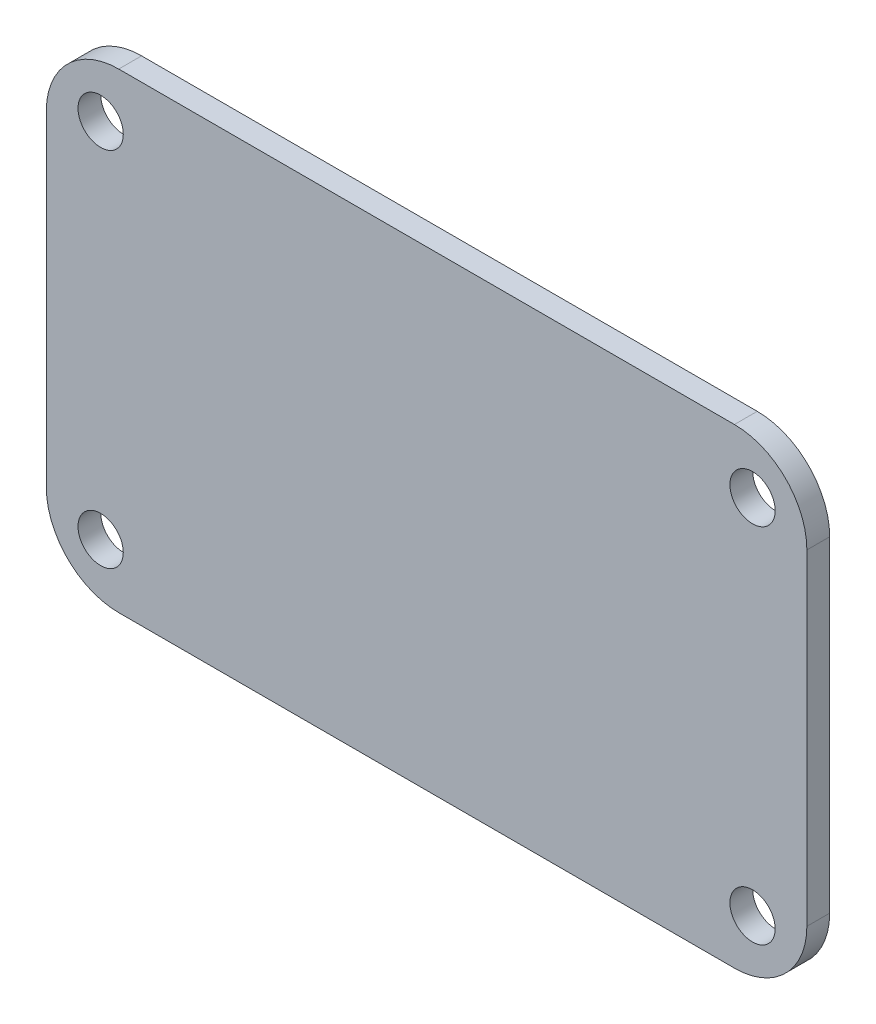
ISO-10303-21;
HEADER;
FILE_DESCRIPTION(('STEP AP214'),'2;1');
FILE_NAME('part.step','',(''),(''),'','','');
FILE_SCHEMA(('AUTOMOTIVE_DESIGN { 1 0 10303 214 1 1 1 1 }'));
ENDSEC;
DATA;
#1=APPLICATION_CONTEXT('core data for automotive mechanical design processes');
#2=APPLICATION_PROTOCOL_DEFINITION('international standard','automotive_design',2000,#1);
#3=PRODUCT_CONTEXT('',#1,'mechanical');
#4=PRODUCT('Part','Part','',(#3));
#5=PRODUCT_RELATED_PRODUCT_CATEGORY('part','',(#4));
#6=PRODUCT_DEFINITION_FORMATION('','',#4);
#7=PRODUCT_DEFINITION_CONTEXT('part definition',#1,'design');
#8=PRODUCT_DEFINITION('design','',#6,#7);
#9=PRODUCT_DEFINITION_SHAPE('','',#8);
#10=(LENGTH_UNIT() NAMED_UNIT(*) SI_UNIT(.MILLI.,.METRE.));
#11=(NAMED_UNIT(*) PLANE_ANGLE_UNIT() SI_UNIT($,.RADIAN.));
#12=(NAMED_UNIT(*) SI_UNIT($,.STERADIAN.) SOLID_ANGLE_UNIT());
#13=UNCERTAINTY_MEASURE_WITH_UNIT(LENGTH_MEASURE(1.E-05),#10,'distance_accuracy_value','');
#14=(GEOMETRIC_REPRESENTATION_CONTEXT(3) GLOBAL_UNCERTAINTY_ASSIGNED_CONTEXT((#13)) GLOBAL_UNIT_ASSIGNED_CONTEXT((#10,
#11,#12)) REPRESENTATION_CONTEXT('',''));
#15=CARTESIAN_POINT('',(0.,0.,0.));
#16=DIRECTION('',(0.,0.,1.));
#17=DIRECTION('',(1.,0.,0.));
#18=AXIS2_PLACEMENT_3D('',#15,#16,#17);
#19=CARTESIAN_POINT('',(-21.59,-11.43,-1.6002));
#20=DIRECTION('',(0.,0.,1.));
#21=DIRECTION('',(1.,0.,0.));
#22=AXIS2_PLACEMENT_3D('',#19,#20,#21);
#23=CYLINDRICAL_SURFACE('',#22,5.08);
#24=CARTESIAN_POINT('',(-21.59,-11.43,0.));
#25=DIRECTION('',(0.,0.,1.));
#26=DIRECTION('',(1.,0.,0.));
#27=AXIS2_PLACEMENT_3D('',#24,#25,#26);
#28=CIRCLE('',#27,5.08);
#29=CARTESIAN_POINT('',(-26.67,-11.43,0.));
#30=VERTEX_POINT('',#29);
#31=CARTESIAN_POINT('',(-21.59,-16.51,0.));
#32=VERTEX_POINT('',#31);
#33=EDGE_CURVE('E130',#30,#32,#28,.T.);
#34=ORIENTED_EDGE('',*,*,#33,.F.);
#35=DIRECTION('',(0.,0.,1.));
#36=VECTOR('',#35,1.);
#37=CARTESIAN_POINT('',(-26.67,-11.43,-1.6002));
#38=LINE('',#37,#36);
#39=CARTESIAN_POINT('',(-26.67,-11.43,-1.6002));
#40=VERTEX_POINT('',#39);
#41=EDGE_CURVE('E11',#40,#30,#38,.T.);
#42=ORIENTED_EDGE('',*,*,#41,.F.);
#43=CARTESIAN_POINT('',(-21.59,-11.43,-1.6002));
#44=DIRECTION('',(0.,0.,1.));
#45=DIRECTION('',(1.,0.,0.));
#46=AXIS2_PLACEMENT_3D('',#43,#44,#45);
#47=CIRCLE('',#46,5.08);
#48=CARTESIAN_POINT('',(-21.59,-16.51,-1.6002));
#49=VERTEX_POINT('',#48);
#50=EDGE_CURVE('E151',#40,#49,#47,.T.);
#51=ORIENTED_EDGE('',*,*,#50,.T.);
#52=DIRECTION('',(0.,0.,1.));
#53=VECTOR('',#52,1.);
#54=CARTESIAN_POINT('',(-21.59,-16.51,-1.6002));
#55=LINE('',#54,#53);
#56=EDGE_CURVE('E36',#49,#32,#55,.T.);
#57=ORIENTED_EDGE('',*,*,#56,.T.);
#58=EDGE_LOOP('',(#34,#42,#51,#57));
#59=FACE_BOUND('',#58,.T.);
#60=ADVANCED_FACE('F33',(#59),#23,.T.);
#61=CARTESIAN_POINT('',(-26.67,11.43,-1.6002));
#62=DIRECTION('',(-1.,0.,0.));
#63=DIRECTION('',(0.,-1.,0.));
#64=AXIS2_PLACEMENT_3D('',#61,#62,#63);
#65=PLANE('',#64);
#66=DIRECTION('',(0.,-1.,0.));
#67=VECTOR('',#66,1.);
#68=CARTESIAN_POINT('',(-26.67,11.43,0.));
#69=LINE('',#68,#67);
#70=CARTESIAN_POINT('',(-26.67,11.43,0.));
#71=VERTEX_POINT('',#70);
#72=EDGE_CURVE('E149',#71,#30,#69,.T.);
#73=ORIENTED_EDGE('',*,*,#72,.F.);
#74=DIRECTION('',(0.,0.,1.));
#75=VECTOR('',#74,1.);
#76=CARTESIAN_POINT('',(-26.67,11.43,-1.6002));
#77=LINE('',#76,#75);
#78=CARTESIAN_POINT('',(-26.67,11.43,-1.6002));
#79=VERTEX_POINT('',#78);
#80=EDGE_CURVE('E42',#79,#71,#77,.T.);
#81=ORIENTED_EDGE('',*,*,#80,.F.);
#82=DIRECTION('',(0.,-1.,0.));
#83=VECTOR('',#82,1.);
#84=CARTESIAN_POINT('',(-26.67,11.43,-1.6002));
#85=LINE('',#84,#83);
#86=EDGE_CURVE('E120',#79,#40,#85,.T.);
#87=ORIENTED_EDGE('',*,*,#86,.T.);
#88=ORIENTED_EDGE('',*,*,#41,.T.);
#89=EDGE_LOOP('',(#73,#81,#87,#88));
#90=FACE_BOUND('',#89,.T.);
#91=ADVANCED_FACE('F163',(#90),#65,.T.);
#92=CARTESIAN_POINT('',(-21.59,11.43,-1.6002));
#93=DIRECTION('',(0.,0.,1.));
#94=DIRECTION('',(1.,0.,0.));
#95=AXIS2_PLACEMENT_3D('',#92,#93,#94);
#96=CYLINDRICAL_SURFACE('',#95,5.08);
#97=CARTESIAN_POINT('',(-21.59,11.43,0.));
#98=DIRECTION('',(0.,0.,1.));
#99=DIRECTION('',(1.,0.,0.));
#100=AXIS2_PLACEMENT_3D('',#97,#98,#99);
#101=CIRCLE('',#100,5.08);
#102=CARTESIAN_POINT('',(-21.59,16.51,0.));
#103=VERTEX_POINT('',#102);
#104=EDGE_CURVE('E107',#103,#71,#101,.T.);
#105=ORIENTED_EDGE('',*,*,#104,.F.);
#106=DIRECTION('',(0.,0.,1.));
#107=VECTOR('',#106,1.);
#108=CARTESIAN_POINT('',(-21.59,16.51,-1.6002));
#109=LINE('',#108,#107);
#110=CARTESIAN_POINT('',(-21.59,16.51,-1.6002));
#111=VERTEX_POINT('',#110);
#112=EDGE_CURVE('E102',#111,#103,#109,.T.);
#113=ORIENTED_EDGE('',*,*,#112,.F.);
#114=CARTESIAN_POINT('',(-21.59,11.43,-1.6002));
#115=DIRECTION('',(0.,0.,1.));
#116=DIRECTION('',(1.,0.,0.));
#117=AXIS2_PLACEMENT_3D('',#114,#115,#116);
#118=CIRCLE('',#117,5.08);
#119=EDGE_CURVE('E105',#111,#79,#118,.T.);
#120=ORIENTED_EDGE('',*,*,#119,.T.);
#121=ORIENTED_EDGE('',*,*,#80,.T.);
#122=EDGE_LOOP('',(#105,#113,#120,#121));
#123=FACE_BOUND('',#122,.T.);
#124=ADVANCED_FACE('F104',(#123),#96,.T.);
#125=CARTESIAN_POINT('',(-21.59,16.51,-1.6002));
#126=DIRECTION('',(0.,1.,0.));
#127=DIRECTION('',(0.,0.,1.));
#128=AXIS2_PLACEMENT_3D('',#125,#126,#127);
#129=PLANE('',#128);
#130=DIRECTION('',(-1.,0.,0.));
#131=VECTOR('',#130,1.);
#132=CARTESIAN_POINT('',(-21.59,16.51,0.));
#133=LINE('',#132,#131);
#134=CARTESIAN_POINT('',(21.59,16.51,0.));
#135=VERTEX_POINT('',#134);
#136=EDGE_CURVE('E146',#135,#103,#133,.T.);
#137=ORIENTED_EDGE('',*,*,#136,.F.);
#138=DIRECTION('',(0.,0.,1.));
#139=VECTOR('',#138,1.);
#140=CARTESIAN_POINT('',(21.59,16.51,-1.6002));
#141=LINE('',#140,#139);
#142=CARTESIAN_POINT('',(21.59,16.51,-1.6002));
#143=VERTEX_POINT('',#142);
#144=EDGE_CURVE('E112',#143,#135,#141,.T.);
#145=ORIENTED_EDGE('',*,*,#144,.F.);
#146=DIRECTION('',(-1.,0.,0.));
#147=VECTOR('',#146,1.);
#148=CARTESIAN_POINT('',(-21.59,16.51,-1.6002));
#149=LINE('',#148,#147);
#150=EDGE_CURVE('E118',#143,#111,#149,.T.);
#151=ORIENTED_EDGE('',*,*,#150,.T.);
#152=ORIENTED_EDGE('',*,*,#112,.T.);
#153=EDGE_LOOP('',(#137,#145,#151,#152));
#154=FACE_BOUND('',#153,.T.);
#155=ADVANCED_FACE('F122',(#154),#129,.T.);
#156=CARTESIAN_POINT('',(21.59,11.43,-1.6002));
#157=DIRECTION('',(0.,0.,1.));
#158=DIRECTION('',(1.,0.,0.));
#159=AXIS2_PLACEMENT_3D('',#156,#157,#158);
#160=CYLINDRICAL_SURFACE('',#159,5.08);
#161=CARTESIAN_POINT('',(21.59,11.43,0.));
#162=DIRECTION('',(0.,0.,1.));
#163=DIRECTION('',(-1.,0.,0.));
#164=AXIS2_PLACEMENT_3D('',#161,#162,#163);
#165=CIRCLE('',#164,5.08);
#166=CARTESIAN_POINT('',(26.67,11.43,0.));
#167=VERTEX_POINT('',#166);
#168=EDGE_CURVE('E143',#167,#135,#165,.T.);
#169=ORIENTED_EDGE('',*,*,#168,.F.);
#170=DIRECTION('',(0.,0.,1.));
#171=VECTOR('',#170,1.);
#172=CARTESIAN_POINT('',(26.67,11.43,-1.6002));
#173=LINE('',#172,#171);
#174=CARTESIAN_POINT('',(26.67,11.43,-1.6002));
#175=VERTEX_POINT('',#174);
#176=EDGE_CURVE('E155',#175,#167,#173,.T.);
#177=ORIENTED_EDGE('',*,*,#176,.F.);
#178=CARTESIAN_POINT('',(21.59,11.43,-1.6002));
#179=DIRECTION('',(0.,0.,1.));
#180=DIRECTION('',(-1.,0.,0.));
#181=AXIS2_PLACEMENT_3D('',#178,#179,#180);
#182=CIRCLE('',#181,5.08);
#183=EDGE_CURVE('E123',#175,#143,#182,.T.);
#184=ORIENTED_EDGE('',*,*,#183,.T.);
#185=ORIENTED_EDGE('',*,*,#144,.T.);
#186=EDGE_LOOP('',(#169,#177,#184,#185));
#187=FACE_BOUND('',#186,.T.);
#188=ADVANCED_FACE('F176',(#187),#160,.T.);
#189=CARTESIAN_POINT('',(26.67,11.43,-1.6002));
#190=DIRECTION('',(1.,0.,0.));
#191=DIRECTION('',(0.,1.,0.));
#192=AXIS2_PLACEMENT_3D('',#189,#190,#191);
#193=PLANE('',#192);
#194=DIRECTION('',(0.,1.,0.));
#195=VECTOR('',#194,1.);
#196=CARTESIAN_POINT('',(26.67,11.43,0.));
#197=LINE('',#196,#195);
#198=CARTESIAN_POINT('',(26.67,-11.43,0.));
#199=VERTEX_POINT('',#198);
#200=EDGE_CURVE('E140',#199,#167,#197,.T.);
#201=ORIENTED_EDGE('',*,*,#200,.F.);
#202=DIRECTION('',(0.,0.,1.));
#203=VECTOR('',#202,1.);
#204=CARTESIAN_POINT('',(26.67,-11.43,-1.6002));
#205=LINE('',#204,#203);
#206=CARTESIAN_POINT('',(26.67,-11.43,-1.6002));
#207=VERTEX_POINT('',#206);
#208=EDGE_CURVE('E157',#207,#199,#205,.T.);
#209=ORIENTED_EDGE('',*,*,#208,.F.);
#210=DIRECTION('',(0.,1.,0.));
#211=VECTOR('',#210,1.);
#212=CARTESIAN_POINT('',(26.67,11.43,-1.6002));
#213=LINE('',#212,#211);
#214=EDGE_CURVE('E125',#207,#175,#213,.T.);
#215=ORIENTED_EDGE('',*,*,#214,.T.);
#216=ORIENTED_EDGE('',*,*,#176,.T.);
#217=EDGE_LOOP('',(#201,#209,#215,#216));
#218=FACE_BOUND('',#217,.T.);
#219=ADVANCED_FACE('F179',(#218),#193,.T.);
#220=CARTESIAN_POINT('',(21.59,-11.43,-1.6002));
#221=DIRECTION('',(0.,0.,1.));
#222=DIRECTION('',(1.,0.,0.));
#223=AXIS2_PLACEMENT_3D('',#220,#221,#222);
#224=CYLINDRICAL_SURFACE('',#223,5.08);
#225=CARTESIAN_POINT('',(21.59,-11.43,0.));
#226=DIRECTION('',(0.,0.,1.));
#227=DIRECTION('',(1.,0.,0.));
#228=AXIS2_PLACEMENT_3D('',#225,#226,#227);
#229=CIRCLE('',#228,5.08);
#230=CARTESIAN_POINT('',(21.59,-16.51,0.));
#231=VERTEX_POINT('',#230);
#232=EDGE_CURVE('E137',#231,#199,#229,.T.);
#233=ORIENTED_EDGE('',*,*,#232,.F.);
#234=DIRECTION('',(0.,0.,1.));
#235=VECTOR('',#234,1.);
#236=CARTESIAN_POINT('',(21.59,-16.51,-1.6002));
#237=LINE('',#236,#235);
#238=CARTESIAN_POINT('',(21.59,-16.51,-1.6002));
#239=VERTEX_POINT('',#238);
#240=EDGE_CURVE('E158',#239,#231,#237,.T.);
#241=ORIENTED_EDGE('',*,*,#240,.F.);
#242=CARTESIAN_POINT('',(21.59,-11.43,-1.6002));
#243=DIRECTION('',(0.,0.,1.));
#244=DIRECTION('',(1.,0.,0.));
#245=AXIS2_PLACEMENT_3D('',#242,#243,#244);
#246=CIRCLE('',#245,5.08);
#247=EDGE_CURVE('E245',#239,#207,#246,.T.);
#248=ORIENTED_EDGE('',*,*,#247,.T.);
#249=ORIENTED_EDGE('',*,*,#208,.T.);
#250=EDGE_LOOP('',(#233,#241,#248,#249));
#251=FACE_BOUND('',#250,.T.);
#252=ADVANCED_FACE('F183',(#251),#224,.T.);
#253=CARTESIAN_POINT('',(-21.59,-16.51,-1.6002));
#254=DIRECTION('',(0.,-1.,0.));
#255=DIRECTION('',(0.,0.,-1.));
#256=AXIS2_PLACEMENT_3D('',#253,#254,#255);
#257=PLANE('',#256);
#258=DIRECTION('',(1.,0.,0.));
#259=VECTOR('',#258,1.);
#260=CARTESIAN_POINT('',(-21.59,-16.51,0.));
#261=LINE('',#260,#259);
#262=EDGE_CURVE('E133',#32,#231,#261,.T.);
#263=ORIENTED_EDGE('',*,*,#262,.F.);
#264=ORIENTED_EDGE('',*,*,#56,.F.);
#265=DIRECTION('',(1.,0.,0.));
#266=VECTOR('',#265,1.);
#267=CARTESIAN_POINT('',(-21.59,-16.51,-1.6002));
#268=LINE('',#267,#266);
#269=EDGE_CURVE('E243',#49,#239,#268,.T.);
#270=ORIENTED_EDGE('',*,*,#269,.T.);
#271=ORIENTED_EDGE('',*,*,#240,.T.);
#272=EDGE_LOOP('',(#263,#264,#270,#271));
#273=FACE_BOUND('',#272,.T.);
#274=ADVANCED_FACE('F160',(#273),#257,.T.);
#275=CARTESIAN_POINT('',(-21.59,-11.43,-1.6002));
#276=DIRECTION('',(0.,0.,1.));
#277=DIRECTION('',(1.,0.,0.));
#278=AXIS2_PLACEMENT_3D('',#275,#276,#277);
#279=PLANE('',#278);
#280=CARTESIAN_POINT('',(22.86,-12.7,-1.6002));
#281=DIRECTION('',(0.,0.,1.));
#282=DIRECTION('',(1.,0.,0.));
#283=AXIS2_PLACEMENT_3D('',#280,#281,#282);
#284=CIRCLE('',#283,1.5875);
#285=CARTESIAN_POINT('',(24.4475,-12.7,-1.6002));
#286=VERTEX_POINT('',#285);
#287=EDGE_CURVE('E221',#286,#286,#284,.T.);
#288=ORIENTED_EDGE('',*,*,#287,.T.);
#289=EDGE_LOOP('',(#288));
#290=FACE_BOUND('',#289,.T.);
#291=CARTESIAN_POINT('',(22.86,12.7,-1.6002));
#292=DIRECTION('',(0.,0.,1.));
#293=DIRECTION('',(1.,0.,0.));
#294=AXIS2_PLACEMENT_3D('',#291,#292,#293);
#295=CIRCLE('',#294,1.5875);
#296=CARTESIAN_POINT('',(24.4475,12.7,-1.6002));
#297=VERTEX_POINT('',#296);
#298=EDGE_CURVE('E225',#297,#297,#295,.T.);
#299=ORIENTED_EDGE('',*,*,#298,.T.);
#300=EDGE_LOOP('',(#299));
#301=FACE_BOUND('',#300,.T.);
#302=CARTESIAN_POINT('',(-22.86,-12.7,-1.6002));
#303=DIRECTION('',(0.,0.,1.));
#304=DIRECTION('',(1.,0.,0.));
#305=AXIS2_PLACEMENT_3D('',#302,#303,#304);
#306=CIRCLE('',#305,1.5875);
#307=CARTESIAN_POINT('',(-21.2725,-12.7,-1.6002));
#308=VERTEX_POINT('',#307);
#309=EDGE_CURVE('E234',#308,#308,#306,.T.);
#310=ORIENTED_EDGE('',*,*,#309,.T.);
#311=EDGE_LOOP('',(#310));
#312=FACE_BOUND('',#311,.T.);
#313=CARTESIAN_POINT('',(-22.86,12.7,-1.6002));
#314=DIRECTION('',(0.,0.,1.));
#315=DIRECTION('',(1.,0.,0.));
#316=AXIS2_PLACEMENT_3D('',#313,#314,#315);
#317=CIRCLE('',#316,1.5875);
#318=CARTESIAN_POINT('',(-21.2725,12.7,-1.6002));
#319=VERTEX_POINT('',#318);
#320=EDGE_CURVE('E134',#319,#319,#317,.T.);
#321=ORIENTED_EDGE('',*,*,#320,.T.);
#322=EDGE_LOOP('',(#321));
#323=FACE_BOUND('',#322,.T.);
#324=ORIENTED_EDGE('',*,*,#50,.F.);
#325=ORIENTED_EDGE('',*,*,#86,.F.);
#326=ORIENTED_EDGE('',*,*,#119,.F.);
#327=ORIENTED_EDGE('',*,*,#150,.F.);
#328=ORIENTED_EDGE('',*,*,#183,.F.);
#329=ORIENTED_EDGE('',*,*,#214,.F.);
#330=ORIENTED_EDGE('',*,*,#247,.F.);
#331=ORIENTED_EDGE('',*,*,#269,.F.);
#332=EDGE_LOOP('',(#324,#325,#326,#327,#328,#329,#330,#331));
#333=FACE_BOUND('',#332,.T.);
#334=ADVANCED_FACE('F116',(#290,#301,#312,#323,#333),#279,.F.);
#335=CARTESIAN_POINT('',(-21.59,-11.43,0.));
#336=DIRECTION('',(0.,0.,1.));
#337=DIRECTION('',(1.,0.,0.));
#338=AXIS2_PLACEMENT_3D('',#335,#336,#337);
#339=PLANE('',#338);
#340=CARTESIAN_POINT('',(22.86,-12.7,0.));
#341=DIRECTION('',(0.,0.,1.));
#342=DIRECTION('',(1.,0.,0.));
#343=AXIS2_PLACEMENT_3D('',#340,#341,#342);
#344=CIRCLE('',#343,1.5875);
#345=CARTESIAN_POINT('',(24.4475,-12.7,0.));
#346=VERTEX_POINT('',#345);
#347=EDGE_CURVE('E219',#346,#346,#344,.T.);
#348=ORIENTED_EDGE('',*,*,#347,.F.);
#349=EDGE_LOOP('',(#348));
#350=FACE_BOUND('',#349,.T.);
#351=CARTESIAN_POINT('',(22.86,12.7,0.));
#352=DIRECTION('',(0.,0.,1.));
#353=DIRECTION('',(1.,0.,0.));
#354=AXIS2_PLACEMENT_3D('',#351,#352,#353);
#355=CIRCLE('',#354,1.5875);
#356=CARTESIAN_POINT('',(24.4475,12.7,0.));
#357=VERTEX_POINT('',#356);
#358=EDGE_CURVE('E222',#357,#357,#355,.T.);
#359=ORIENTED_EDGE('',*,*,#358,.F.);
#360=EDGE_LOOP('',(#359));
#361=FACE_BOUND('',#360,.T.);
#362=CARTESIAN_POINT('',(-22.86,-12.7,0.));
#363=DIRECTION('',(0.,0.,1.));
#364=DIRECTION('',(1.,0.,0.));
#365=AXIS2_PLACEMENT_3D('',#362,#363,#364);
#366=CIRCLE('',#365,1.5875);
#367=CARTESIAN_POINT('',(-21.2725,-12.7,0.));
#368=VERTEX_POINT('',#367);
#369=EDGE_CURVE('E231',#368,#368,#366,.T.);
#370=ORIENTED_EDGE('',*,*,#369,.F.);
#371=EDGE_LOOP('',(#370));
#372=FACE_BOUND('',#371,.T.);
#373=CARTESIAN_POINT('',(-22.86,12.7,0.));
#374=DIRECTION('',(0.,0.,1.));
#375=DIRECTION('',(1.,0.,0.));
#376=AXIS2_PLACEMENT_3D('',#373,#374,#375);
#377=CIRCLE('',#376,1.5875);
#378=CARTESIAN_POINT('',(-21.2725,12.7,0.));
#379=VERTEX_POINT('',#378);
#380=EDGE_CURVE('E237',#379,#379,#377,.T.);
#381=ORIENTED_EDGE('',*,*,#380,.F.);
#382=EDGE_LOOP('',(#381));
#383=FACE_BOUND('',#382,.T.);
#384=ORIENTED_EDGE('',*,*,#33,.T.);
#385=ORIENTED_EDGE('',*,*,#262,.T.);
#386=ORIENTED_EDGE('',*,*,#232,.T.);
#387=ORIENTED_EDGE('',*,*,#200,.T.);
#388=ORIENTED_EDGE('',*,*,#168,.T.);
#389=ORIENTED_EDGE('',*,*,#136,.T.);
#390=ORIENTED_EDGE('',*,*,#104,.T.);
#391=ORIENTED_EDGE('',*,*,#72,.T.);
#392=EDGE_LOOP('',(#384,#385,#386,#387,#388,#389,#390,#391));
#393=FACE_BOUND('',#392,.T.);
#394=ADVANCED_FACE('F162',(#350,#361,#372,#383,#393),#339,.T.);
#395=CARTESIAN_POINT('',(-22.86,12.7,-11.7602));
#396=DIRECTION('',(0.,0.,1.));
#397=DIRECTION('',(1.,0.,0.));
#398=AXIS2_PLACEMENT_3D('',#395,#396,#397);
#399=CYLINDRICAL_SURFACE('',#398,1.5875);
#400=ORIENTED_EDGE('',*,*,#380,.T.);
#401=EDGE_LOOP('',(#400));
#402=FACE_BOUND('',#401,.T.);
#403=ORIENTED_EDGE('',*,*,#320,.F.);
#404=EDGE_LOOP('',(#403));
#405=FACE_BOUND('',#404,.T.);
#406=ADVANCED_FACE('F195',(#402,#405),#399,.F.);
#407=CARTESIAN_POINT('',(-22.86,-12.7,-11.7602));
#408=DIRECTION('',(0.,0.,1.));
#409=DIRECTION('',(1.,0.,0.));
#410=AXIS2_PLACEMENT_3D('',#407,#408,#409);
#411=CYLINDRICAL_SURFACE('',#410,1.5875);
#412=ORIENTED_EDGE('',*,*,#369,.T.);
#413=EDGE_LOOP('',(#412));
#414=FACE_BOUND('',#413,.T.);
#415=ORIENTED_EDGE('',*,*,#309,.F.);
#416=EDGE_LOOP('',(#415));
#417=FACE_BOUND('',#416,.T.);
#418=ADVANCED_FACE('F202',(#414,#417),#411,.F.);
#419=CARTESIAN_POINT('',(22.86,12.7,-11.7602));
#420=DIRECTION('',(0.,0.,1.));
#421=DIRECTION('',(1.,0.,0.));
#422=AXIS2_PLACEMENT_3D('',#419,#420,#421);
#423=CYLINDRICAL_SURFACE('',#422,1.5875);
#424=ORIENTED_EDGE('',*,*,#358,.T.);
#425=EDGE_LOOP('',(#424));
#426=FACE_BOUND('',#425,.T.);
#427=ORIENTED_EDGE('',*,*,#298,.F.);
#428=EDGE_LOOP('',(#427));
#429=FACE_BOUND('',#428,.T.);
#430=ADVANCED_FACE('F206',(#426,#429),#423,.F.);
#431=CARTESIAN_POINT('',(22.86,-12.7,-11.7602));
#432=DIRECTION('',(0.,0.,1.));
#433=DIRECTION('',(1.,0.,0.));
#434=AXIS2_PLACEMENT_3D('',#431,#432,#433);
#435=CYLINDRICAL_SURFACE('',#434,1.5875);
#436=ORIENTED_EDGE('',*,*,#347,.T.);
#437=EDGE_LOOP('',(#436));
#438=FACE_BOUND('',#437,.T.);
#439=ORIENTED_EDGE('',*,*,#287,.F.);
#440=EDGE_LOOP('',(#439));
#441=FACE_BOUND('',#440,.T.);
#442=ADVANCED_FACE('F210',(#438,#441),#435,.F.);
#443=CLOSED_SHELL('',(#60,#91,#124,#155,#188,#219,#252,#274,#334,#394,#406,#418,#430,#442));
#444=MANIFOLD_SOLID_BREP('B2',#443);
#445=ADVANCED_BREP_SHAPE_REPRESENTATION('',(#18,#444),#14);
#446=SHAPE_DEFINITION_REPRESENTATION(#9,#445);
ENDSEC;
END-ISO-10303-21;
